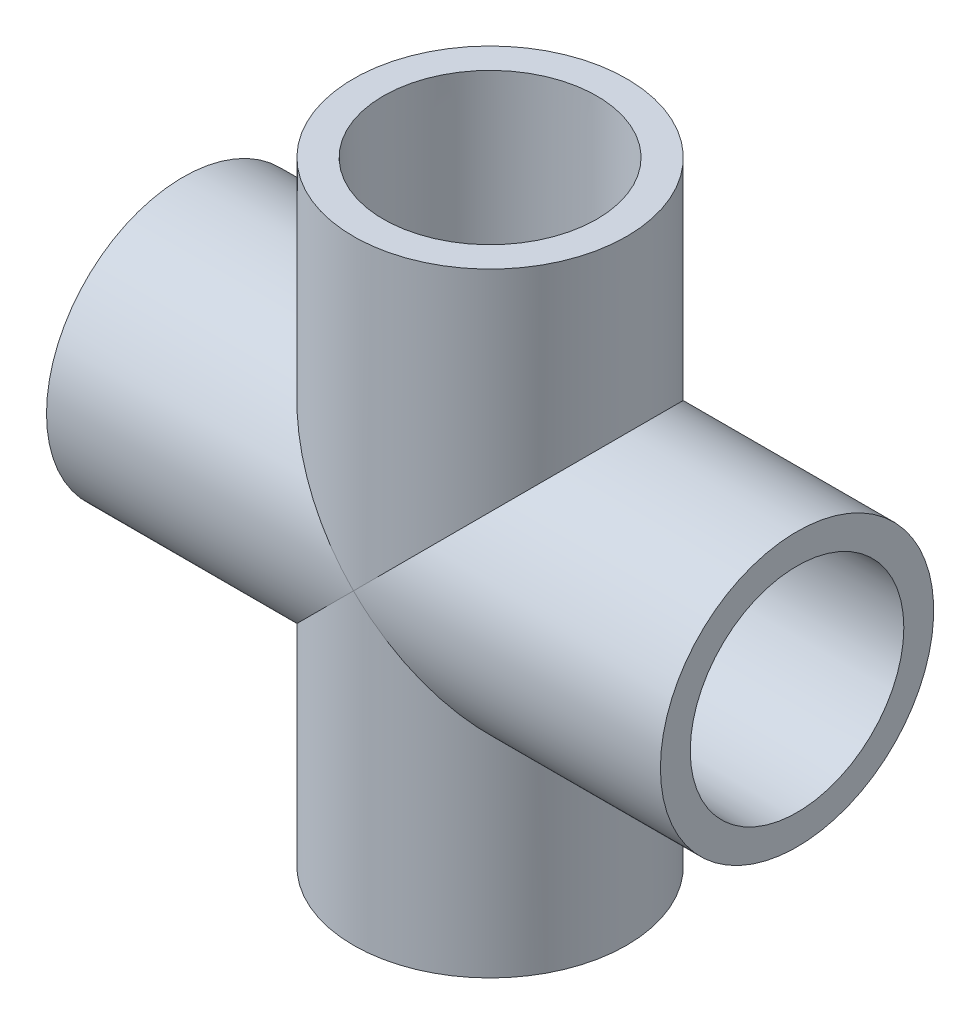
ISO-10303-21;
HEADER;
FILE_DESCRIPTION(('STEP AP214'),'2;1');
FILE_NAME('part.step','',(''),(''),'','','');
FILE_SCHEMA(('AUTOMOTIVE_DESIGN { 1 0 10303 214 1 1 1 1 }'));
ENDSEC;
DATA;
#1=APPLICATION_CONTEXT('core data for automotive mechanical design processes');
#2=APPLICATION_PROTOCOL_DEFINITION('international standard','automotive_design',2000,#1);
#3=PRODUCT_CONTEXT('',#1,'mechanical');
#4=PRODUCT('Part','Part','',(#3));
#5=PRODUCT_RELATED_PRODUCT_CATEGORY('part','',(#4));
#6=PRODUCT_DEFINITION_FORMATION('','',#4);
#7=PRODUCT_DEFINITION_CONTEXT('part definition',#1,'design');
#8=PRODUCT_DEFINITION('design','',#6,#7);
#9=PRODUCT_DEFINITION_SHAPE('','',#8);
#10=(LENGTH_UNIT() NAMED_UNIT(*) SI_UNIT(.MILLI.,.METRE.));
#11=(NAMED_UNIT(*) PLANE_ANGLE_UNIT() SI_UNIT($,.RADIAN.));
#12=(NAMED_UNIT(*) SI_UNIT($,.STERADIAN.) SOLID_ANGLE_UNIT());
#13=UNCERTAINTY_MEASURE_WITH_UNIT(LENGTH_MEASURE(1.E-05),#10,'distance_accuracy_value','');
#14=(GEOMETRIC_REPRESENTATION_CONTEXT(3) GLOBAL_UNCERTAINTY_ASSIGNED_CONTEXT((#13)) GLOBAL_UNIT_ASSIGNED_CONTEXT((#10,
#11,#12)) REPRESENTATION_CONTEXT('',''));
#15=CARTESIAN_POINT('',(0.,0.,0.));
#16=DIRECTION('',(0.,0.,1.));
#17=DIRECTION('',(1.,0.,0.));
#18=AXIS2_PLACEMENT_3D('',#15,#16,#17);
#19=CARTESIAN_POINT('',(0.,13.49375,0.));
#20=DIRECTION('',(0.,-1.,0.));
#21=DIRECTION('',(1.,0.,0.));
#22=AXIS2_PLACEMENT_3D('',#19,#20,#21);
#23=PLANE('',#22);
#24=CARTESIAN_POINT('',(0.,13.49375,0.));
#25=DIRECTION('',(0.,-1.,0.));
#26=DIRECTION('',(1.,0.,0.));
#27=AXIS2_PLACEMENT_3D('',#24,#25,#26);
#28=CIRCLE('',#27,10.6172);
#29=CARTESIAN_POINT('',(10.6172,13.49375,0.));
#30=VERTEX_POINT('',#29);
#31=EDGE_CURVE('E80',#30,#30,#28,.T.);
#32=ORIENTED_EDGE('',*,*,#31,.F.);
#33=EDGE_LOOP('',(#32));
#34=FACE_BOUND('',#33,.T.);
#35=CARTESIAN_POINT('',(0.,13.49375,0.));
#36=DIRECTION('',(0.,1.,0.));
#37=DIRECTION('',(-1.,0.,0.));
#38=AXIS2_PLACEMENT_3D('',#35,#36,#37);
#39=CIRCLE('',#38,7.89940000000001);
#40=CARTESIAN_POINT('',(-7.89940000000001,13.49375,0.));
#41=VERTEX_POINT('',#40);
#42=EDGE_CURVE('E124',#41,#41,#39,.T.);
#43=ORIENTED_EDGE('',*,*,#42,.F.);
#44=EDGE_LOOP('',(#43));
#45=FACE_BOUND('',#44,.T.);
#46=ADVANCED_FACE('F32',(#34,#45),#23,.F.);
#47=CARTESIAN_POINT('',(0.,-13.49375,0.));
#48=DIRECTION('',(0.,-1.,0.));
#49=DIRECTION('',(1.,0.,0.));
#50=AXIS2_PLACEMENT_3D('',#47,#48,#49);
#51=PLANE('',#50);
#52=CARTESIAN_POINT('',(0.,-13.49375,0.));
#53=DIRECTION('',(0.,1.,0.));
#54=DIRECTION('',(-1.,0.,0.));
#55=AXIS2_PLACEMENT_3D('',#52,#53,#54);
#56=CIRCLE('',#55,7.89940000000001);
#57=CARTESIAN_POINT('',(-7.89940000000001,-13.49375,0.));
#58=VERTEX_POINT('',#57);
#59=EDGE_CURVE('E127',#58,#58,#56,.T.);
#60=ORIENTED_EDGE('',*,*,#59,.T.);
#61=EDGE_LOOP('',(#60));
#62=FACE_BOUND('',#61,.T.);
#63=CARTESIAN_POINT('',(0.,-13.49375,0.));
#64=DIRECTION('',(0.,-1.,0.));
#65=DIRECTION('',(1.,0.,0.));
#66=AXIS2_PLACEMENT_3D('',#63,#64,#65);
#67=CIRCLE('',#66,10.6172);
#68=CARTESIAN_POINT('',(10.6172,-13.49375,0.));
#69=VERTEX_POINT('',#68);
#70=EDGE_CURVE('E115',#69,#69,#67,.T.);
#71=ORIENTED_EDGE('',*,*,#70,.T.);
#72=EDGE_LOOP('',(#71));
#73=FACE_BOUND('',#72,.T.);
#74=ADVANCED_FACE('F131',(#62,#73),#51,.T.);
#75=CARTESIAN_POINT('',(30.95625,0.,0.));
#76=DIRECTION('',(1.,0.,0.));
#77=DIRECTION('',(0.,0.,-1.));
#78=AXIS2_PLACEMENT_3D('',#75,#76,#77);
#79=CYLINDRICAL_SURFACE('',#78,7.8994);
#80=CARTESIAN_POINT('',(13.49375,0.,0.));
#81=DIRECTION('',(1.,0.,0.));
#82=DIRECTION('',(0.,0.,-1.));
#83=AXIS2_PLACEMENT_3D('',#80,#81,#82);
#84=CIRCLE('',#83,7.8994);
#85=CARTESIAN_POINT('',(13.49375,0.,-7.8994));
#86=VERTEX_POINT('',#85);
#87=EDGE_CURVE('E121',#86,#86,#84,.T.);
#88=ORIENTED_EDGE('',*,*,#87,.T.);
#89=EDGE_LOOP('',(#88));
#90=FACE_BOUND('',#89,.T.);
#91=CARTESIAN_POINT('',(0.,0.,0.));
#92=DIRECTION('',(0.707106781186548,-0.707106781186547,0.));
#93=DIRECTION('',(0.707106781186547,0.707106781186548,0.));
#94=AXIS2_PLACEMENT_3D('',#91,#92,#93);
#95=ELLIPSE('',#94,11.17143861461,7.8994);
#96=CARTESIAN_POINT('',(0.,0.,7.8994));
#97=VERTEX_POINT('',#96);
#98=CARTESIAN_POINT('',(0.,0.,-7.8994));
#99=VERTEX_POINT('',#98);
#100=EDGE_CURVE('E45',#97,#99,#95,.F.);
#101=ORIENTED_EDGE('',*,*,#100,.T.);
#102=CARTESIAN_POINT('',(0.,0.,0.));
#103=DIRECTION('',(0.707106781186547,0.707106781186548,0.));
#104=DIRECTION('',(0.707106781186548,-0.707106781186547,0.));
#105=AXIS2_PLACEMENT_3D('',#102,#103,#104);
#106=ELLIPSE('',#105,11.17143861461,7.8994);
#107=EDGE_CURVE('E11',#99,#97,#106,.F.);
#108=ORIENTED_EDGE('',*,*,#107,.T.);
#109=EDGE_LOOP('',(#101,#108));
#110=FACE_BOUND('',#109,.T.);
#111=ADVANCED_FACE('F72',(#90,#110),#79,.F.);
#112=CARTESIAN_POINT('',(-13.49375,0.,0.));
#113=DIRECTION('',(1.,0.,0.));
#114=DIRECTION('',(0.,0.,-1.));
#115=AXIS2_PLACEMENT_3D('',#112,#113,#114);
#116=CIRCLE('',#115,7.8994);
#117=CARTESIAN_POINT('',(-13.49375,0.,-7.8994));
#118=VERTEX_POINT('',#117);
#119=EDGE_CURVE('E118',#118,#118,#116,.T.);
#120=ORIENTED_EDGE('',*,*,#119,.F.);
#121=EDGE_LOOP('',(#120));
#122=FACE_BOUND('',#121,.T.);
#123=CARTESIAN_POINT('',(0.,0.,0.));
#124=DIRECTION('',(0.707106781186548,-0.707106781186547,0.));
#125=DIRECTION('',(0.707106781186547,0.707106781186548,0.));
#126=AXIS2_PLACEMENT_3D('',#123,#124,#125);
#127=ELLIPSE('',#126,11.17143861461,7.8994);
#128=EDGE_CURVE('E62',#97,#99,#127,.T.);
#129=ORIENTED_EDGE('',*,*,#128,.T.);
#130=CARTESIAN_POINT('',(0.,0.,0.));
#131=DIRECTION('',(0.707106781186547,0.707106781186548,0.));
#132=DIRECTION('',(0.707106781186548,-0.707106781186547,0.));
#133=AXIS2_PLACEMENT_3D('',#130,#131,#132);
#134=ELLIPSE('',#133,11.17143861461,7.8994);
#135=EDGE_CURVE('E40',#99,#97,#134,.T.);
#136=ORIENTED_EDGE('',*,*,#135,.T.);
#137=EDGE_LOOP('',(#129,#136));
#138=FACE_BOUND('',#137,.T.);
#139=ADVANCED_FACE('F73',(#122,#138),#79,.F.);
#140=CARTESIAN_POINT('',(-13.49375,0.,0.));
#141=DIRECTION('',(1.,0.,0.));
#142=DIRECTION('',(0.,0.,-1.));
#143=AXIS2_PLACEMENT_3D('',#140,#141,#142);
#144=PLANE('',#143);
#145=ORIENTED_EDGE('',*,*,#119,.T.);
#146=EDGE_LOOP('',(#145));
#147=FACE_BOUND('',#146,.T.);
#148=CARTESIAN_POINT('',(-13.49375,0.,0.));
#149=DIRECTION('',(-1.,0.,0.));
#150=DIRECTION('',(0.,0.,1.));
#151=AXIS2_PLACEMENT_3D('',#148,#149,#150);
#152=CIRCLE('',#151,10.6172);
#153=CARTESIAN_POINT('',(-13.49375,0.,10.6172));
#154=VERTEX_POINT('',#153);
#155=EDGE_CURVE('E92',#154,#154,#152,.T.);
#156=ORIENTED_EDGE('',*,*,#155,.T.);
#157=EDGE_LOOP('',(#156));
#158=FACE_BOUND('',#157,.T.);
#159=ADVANCED_FACE('F179',(#147,#158),#144,.F.);
#160=CARTESIAN_POINT('',(13.49375,0.,0.));
#161=DIRECTION('',(1.,0.,0.));
#162=DIRECTION('',(0.,0.,-1.));
#163=AXIS2_PLACEMENT_3D('',#160,#161,#162);
#164=PLANE('',#163);
#165=CARTESIAN_POINT('',(13.49375,0.,0.));
#166=DIRECTION('',(1.,0.,0.));
#167=DIRECTION('',(0.,0.,-1.));
#168=AXIS2_PLACEMENT_3D('',#165,#166,#167);
#169=CIRCLE('',#168,10.6172);
#170=CARTESIAN_POINT('',(13.49375,0.,-10.6172));
#171=VERTEX_POINT('',#170);
#172=EDGE_CURVE('E70',#171,#171,#169,.F.);
#173=ORIENTED_EDGE('',*,*,#172,.F.);
#174=EDGE_LOOP('',(#173));
#175=FACE_BOUND('',#174,.T.);
#176=ORIENTED_EDGE('',*,*,#87,.F.);
#177=EDGE_LOOP('',(#176));
#178=FACE_BOUND('',#177,.T.);
#179=ADVANCED_FACE('F175',(#175,#178),#164,.T.);
#180=CARTESIAN_POINT('',(13.49375,0.,0.));
#181=DIRECTION('',(-1.,0.,0.));
#182=DIRECTION('',(0.,0.,1.));
#183=AXIS2_PLACEMENT_3D('',#180,#181,#182);
#184=CYLINDRICAL_SURFACE('',#183,13.7795);
#185=CARTESIAN_POINT('',(30.95625,0.,0.));
#186=DIRECTION('',(-1.,0.,0.));
#187=DIRECTION('',(0.,0.,1.));
#188=AXIS2_PLACEMENT_3D('',#185,#186,#187);
#189=CIRCLE('',#188,13.7795);
#190=CARTESIAN_POINT('',(30.95625,0.,13.7795));
#191=VERTEX_POINT('',#190);
#192=EDGE_CURVE('E103',#191,#191,#189,.T.);
#193=ORIENTED_EDGE('',*,*,#192,.T.);
#194=EDGE_LOOP('',(#193));
#195=FACE_BOUND('',#194,.T.);
#196=CARTESIAN_POINT('',(0.,0.,0.));
#197=DIRECTION('',(-0.707106781186547,-0.707106781186547,0.));
#198=DIRECTION('',(-0.707106781186547,0.707106781186547,0.));
#199=AXIS2_PLACEMENT_3D('',#196,#197,#198);
#200=ELLIPSE('',#199,19.4871557827201,13.7795);
#201=CARTESIAN_POINT('',(0.,0.,-13.7795));
#202=VERTEX_POINT('',#201);
#203=CARTESIAN_POINT('',(0.,0.,13.7795));
#204=VERTEX_POINT('',#203);
#205=EDGE_CURVE('E107',#202,#204,#200,.T.);
#206=ORIENTED_EDGE('',*,*,#205,.F.);
#207=CARTESIAN_POINT('',(0.,0.,0.));
#208=DIRECTION('',(0.707106781186547,-0.707106781186548,0.));
#209=DIRECTION('',(-0.707106781186548,-0.707106781186547,0.));
#210=AXIS2_PLACEMENT_3D('',#207,#208,#209);
#211=ELLIPSE('',#210,19.4871557827201,13.7795);
#212=EDGE_CURVE('E98',#202,#204,#211,.T.);
#213=ORIENTED_EDGE('',*,*,#212,.T.);
#214=EDGE_LOOP('',(#206,#213));
#215=FACE_BOUND('',#214,.T.);
#216=ADVANCED_FACE('F178',(#195,#215),#184,.T.);
#217=CARTESIAN_POINT('',(-30.95625,0.,0.));
#218=DIRECTION('',(-1.,0.,0.));
#219=DIRECTION('',(0.,0.,1.));
#220=AXIS2_PLACEMENT_3D('',#217,#218,#219);
#221=CIRCLE('',#220,13.7795);
#222=CARTESIAN_POINT('',(-30.95625,0.,13.7795));
#223=VERTEX_POINT('',#222);
#224=EDGE_CURVE('E95',#223,#223,#221,.T.);
#225=ORIENTED_EDGE('',*,*,#224,.F.);
#226=EDGE_LOOP('',(#225));
#227=FACE_BOUND('',#226,.T.);
#228=CARTESIAN_POINT('',(0.,0.,0.));
#229=DIRECTION('',(-0.707106781186548,-0.707106781186547,0.));
#230=DIRECTION('',(0.707106781186547,-0.707106781186548,0.));
#231=AXIS2_PLACEMENT_3D('',#228,#229,#230);
#232=ELLIPSE('',#231,19.4871557827201,13.7795);
#233=EDGE_CURVE('E86',#204,#202,#232,.T.);
#234=ORIENTED_EDGE('',*,*,#233,.T.);
#235=CARTESIAN_POINT('',(0.,0.,0.));
#236=DIRECTION('',(-0.707106781186547,0.707106781186547,0.));
#237=DIRECTION('',(-0.707106781186547,-0.707106781186547,0.));
#238=AXIS2_PLACEMENT_3D('',#235,#236,#237);
#239=ELLIPSE('',#238,19.4871557827201,13.7795);
#240=EDGE_CURVE('E52',#204,#202,#239,.F.);
#241=ORIENTED_EDGE('',*,*,#240,.F.);
#242=EDGE_LOOP('',(#234,#241));
#243=FACE_BOUND('',#242,.T.);
#244=ADVANCED_FACE('F169',(#227,#243),#184,.T.);
#245=CARTESIAN_POINT('',(-13.49375,0.,0.));
#246=DIRECTION('',(-1.,0.,0.));
#247=DIRECTION('',(0.,0.,1.));
#248=AXIS2_PLACEMENT_3D('',#245,#246,#247);
#249=CONICAL_SURFACE('',#248,10.6172,0.00872705116564709);
#250=CARTESIAN_POINT('',(-30.95625,0.,0.));
#251=DIRECTION('',(-1.,0.,0.));
#252=DIRECTION('',(0.,0.,1.));
#253=AXIS2_PLACEMENT_3D('',#250,#251,#252);
#254=CIRCLE('',#253,10.7696);
#255=CARTESIAN_POINT('',(-30.95625,0.,10.7696));
#256=VERTEX_POINT('',#255);
#257=EDGE_CURVE('E89',#256,#256,#254,.T.);
#258=ORIENTED_EDGE('',*,*,#257,.T.);
#259=EDGE_LOOP('',(#258));
#260=FACE_BOUND('',#259,.T.);
#261=ORIENTED_EDGE('',*,*,#155,.F.);
#262=EDGE_LOOP('',(#261));
#263=FACE_BOUND('',#262,.T.);
#264=ADVANCED_FACE('F161',(#260,#263),#249,.F.);
#265=CARTESIAN_POINT('',(30.95625,0.,0.));
#266=DIRECTION('',(1.,0.,0.));
#267=DIRECTION('',(0.,0.,-1.));
#268=AXIS2_PLACEMENT_3D('',#265,#266,#267);
#269=CONICAL_SURFACE('',#268,10.7696,0.00872705116564689);
#270=CARTESIAN_POINT('',(30.95625,0.,0.));
#271=DIRECTION('',(-1.,0.,0.));
#272=DIRECTION('',(0.,0.,1.));
#273=AXIS2_PLACEMENT_3D('',#270,#271,#272);
#274=CIRCLE('',#273,10.7696);
#275=CARTESIAN_POINT('',(30.95625,0.,10.7696));
#276=VERTEX_POINT('',#275);
#277=EDGE_CURVE('E100',#276,#276,#274,.T.);
#278=ORIENTED_EDGE('',*,*,#277,.F.);
#279=EDGE_LOOP('',(#278));
#280=FACE_BOUND('',#279,.T.);
#281=ORIENTED_EDGE('',*,*,#172,.T.);
#282=EDGE_LOOP('',(#281));
#283=FACE_BOUND('',#282,.T.);
#284=ADVANCED_FACE('F157',(#280,#283),#269,.F.);
#285=CARTESIAN_POINT('',(0.,30.95625,0.));
#286=DIRECTION('',(0.,1.,0.));
#287=DIRECTION('',(-1.,0.,0.));
#288=AXIS2_PLACEMENT_3D('',#285,#286,#287);
#289=CONICAL_SURFACE('',#288,10.7696,0.00872705116564708);
#290=CARTESIAN_POINT('',(0.,30.95625,0.));
#291=DIRECTION('',(0.,-1.,0.));
#292=DIRECTION('',(1.,0.,0.));
#293=AXIS2_PLACEMENT_3D('',#290,#291,#292);
#294=CIRCLE('',#293,10.7696);
#295=CARTESIAN_POINT('',(10.7696,30.95625,0.));
#296=VERTEX_POINT('',#295);
#297=EDGE_CURVE('E83',#296,#296,#294,.T.);
#298=ORIENTED_EDGE('',*,*,#297,.F.);
#299=EDGE_LOOP('',(#298));
#300=FACE_BOUND('',#299,.T.);
#301=ORIENTED_EDGE('',*,*,#31,.T.);
#302=EDGE_LOOP('',(#301));
#303=FACE_BOUND('',#302,.T.);
#304=ADVANCED_FACE('F160',(#300,#303),#289,.F.);
#305=CARTESIAN_POINT('',(13.7795,30.95625,0.));
#306=DIRECTION('',(0.,1.,0.));
#307=DIRECTION('',(-1.,0.,0.));
#308=AXIS2_PLACEMENT_3D('',#305,#306,#307);
#309=PLANE('',#308);
#310=ORIENTED_EDGE('',*,*,#297,.T.);
#311=EDGE_LOOP('',(#310));
#312=FACE_BOUND('',#311,.T.);
#313=CARTESIAN_POINT('',(0.,30.95625,0.));
#314=DIRECTION('',(0.,-1.,0.));
#315=DIRECTION('',(1.,0.,0.));
#316=AXIS2_PLACEMENT_3D('',#313,#314,#315);
#317=CIRCLE('',#316,13.7795);
#318=CARTESIAN_POINT('',(13.7795,30.95625,0.));
#319=VERTEX_POINT('',#318);
#320=EDGE_CURVE('E77',#319,#319,#317,.T.);
#321=ORIENTED_EDGE('',*,*,#320,.F.);
#322=EDGE_LOOP('',(#321));
#323=FACE_BOUND('',#322,.T.);
#324=ADVANCED_FACE('F34',(#312,#323),#309,.T.);
#325=CARTESIAN_POINT('',(0.,0.,0.));
#326=DIRECTION('',(0.,-1.,0.));
#327=DIRECTION('',(1.,0.,0.));
#328=AXIS2_PLACEMENT_3D('',#325,#326,#327);
#329=CYLINDRICAL_SURFACE('',#328,13.7795);
#330=ORIENTED_EDGE('',*,*,#212,.F.);
#331=ORIENTED_EDGE('',*,*,#233,.F.);
#332=EDGE_LOOP('',(#330,#331));
#333=FACE_BOUND('',#332,.T.);
#334=ORIENTED_EDGE('',*,*,#320,.T.);
#335=EDGE_LOOP('',(#334));
#336=FACE_BOUND('',#335,.T.);
#337=ADVANCED_FACE('F173',(#333,#336),#329,.T.);
#338=CARTESIAN_POINT('',(-30.95625,-13.7795,0.));
#339=DIRECTION('',(-1.,0.,0.));
#340=DIRECTION('',(0.,0.,1.));
#341=AXIS2_PLACEMENT_3D('',#338,#339,#340);
#342=PLANE('',#341);
#343=ORIENTED_EDGE('',*,*,#224,.T.);
#344=EDGE_LOOP('',(#343));
#345=FACE_BOUND('',#344,.T.);
#346=ORIENTED_EDGE('',*,*,#257,.F.);
#347=EDGE_LOOP('',(#346));
#348=FACE_BOUND('',#347,.T.);
#349=ADVANCED_FACE('F165',(#345,#348),#342,.T.);
#350=CARTESIAN_POINT('',(30.95625,-13.7795,0.));
#351=DIRECTION('',(1.,0.,0.));
#352=DIRECTION('',(0.,0.,-1.));
#353=AXIS2_PLACEMENT_3D('',#350,#351,#352);
#354=PLANE('',#353);
#355=ORIENTED_EDGE('',*,*,#277,.T.);
#356=EDGE_LOOP('',(#355));
#357=FACE_BOUND('',#356,.T.);
#358=ORIENTED_EDGE('',*,*,#192,.F.);
#359=EDGE_LOOP('',(#358));
#360=FACE_BOUND('',#359,.T.);
#361=ADVANCED_FACE('F156',(#357,#360),#354,.T.);
#362=CARTESIAN_POINT('',(0.,-13.49375,0.));
#363=DIRECTION('',(0.,1.,0.));
#364=DIRECTION('',(-1.,0.,0.));
#365=AXIS2_PLACEMENT_3D('',#362,#363,#364);
#366=CYLINDRICAL_SURFACE('',#365,13.7795);
#367=ORIENTED_EDGE('',*,*,#205,.T.);
#368=ORIENTED_EDGE('',*,*,#240,.T.);
#369=EDGE_LOOP('',(#367,#368));
#370=FACE_BOUND('',#369,.T.);
#371=CARTESIAN_POINT('',(0.,-30.95625,0.));
#372=DIRECTION('',(0.,-1.,0.));
#373=DIRECTION('',(1.,0.,0.));
#374=AXIS2_PLACEMENT_3D('',#371,#372,#373);
#375=CIRCLE('',#374,13.7795);
#376=CARTESIAN_POINT('',(13.7795,-30.95625,0.));
#377=VERTEX_POINT('',#376);
#378=EDGE_CURVE('E109',#377,#377,#375,.T.);
#379=ORIENTED_EDGE('',*,*,#378,.F.);
#380=EDGE_LOOP('',(#379));
#381=FACE_BOUND('',#380,.T.);
#382=ADVANCED_FACE('F152',(#370,#381),#366,.T.);
#383=CARTESIAN_POINT('',(0.,-13.49375,0.));
#384=DIRECTION('',(0.,-1.,0.));
#385=DIRECTION('',(1.,0.,0.));
#386=AXIS2_PLACEMENT_3D('',#383,#384,#385);
#387=CONICAL_SURFACE('',#386,10.6172,0.00872705116564748);
#388=CARTESIAN_POINT('',(0.,-30.95625,0.));
#389=DIRECTION('',(0.,-1.,0.));
#390=DIRECTION('',(1.,0.,0.));
#391=AXIS2_PLACEMENT_3D('',#388,#389,#390);
#392=CIRCLE('',#391,10.7696);
#393=CARTESIAN_POINT('',(10.7696,-30.95625,0.));
#394=VERTEX_POINT('',#393);
#395=EDGE_CURVE('E112',#394,#394,#392,.T.);
#396=ORIENTED_EDGE('',*,*,#395,.T.);
#397=EDGE_LOOP('',(#396));
#398=FACE_BOUND('',#397,.T.);
#399=ORIENTED_EDGE('',*,*,#70,.F.);
#400=EDGE_LOOP('',(#399));
#401=FACE_BOUND('',#400,.T.);
#402=ADVANCED_FACE('F155',(#398,#401),#387,.F.);
#403=CARTESIAN_POINT('',(13.7795,-30.95625,0.));
#404=DIRECTION('',(0.,-1.,0.));
#405=DIRECTION('',(1.,0.,0.));
#406=AXIS2_PLACEMENT_3D('',#403,#404,#405);
#407=PLANE('',#406);
#408=ORIENTED_EDGE('',*,*,#378,.T.);
#409=EDGE_LOOP('',(#408));
#410=FACE_BOUND('',#409,.T.);
#411=ORIENTED_EDGE('',*,*,#395,.F.);
#412=EDGE_LOOP('',(#411));
#413=FACE_BOUND('',#412,.T.);
#414=ADVANCED_FACE('F138',(#410,#413),#407,.T.);
#415=CARTESIAN_POINT('',(0.,30.95625,0.));
#416=DIRECTION('',(0.,1.,0.));
#417=DIRECTION('',(-1.,0.,0.));
#418=AXIS2_PLACEMENT_3D('',#415,#416,#417);
#419=CYLINDRICAL_SURFACE('',#418,7.89940000000001);
#420=ORIENTED_EDGE('',*,*,#42,.T.);
#421=EDGE_LOOP('',(#420));
#422=FACE_BOUND('',#421,.T.);
#423=ORIENTED_EDGE('',*,*,#100,.F.);
#424=ORIENTED_EDGE('',*,*,#135,.F.);
#425=EDGE_LOOP('',(#423,#424));
#426=FACE_BOUND('',#425,.T.);
#427=ADVANCED_FACE('F69',(#422,#426),#419,.F.);
#428=ORIENTED_EDGE('',*,*,#128,.F.);
#429=ORIENTED_EDGE('',*,*,#107,.F.);
#430=EDGE_LOOP('',(#428,#429));
#431=FACE_BOUND('',#430,.T.);
#432=ORIENTED_EDGE('',*,*,#59,.F.);
#433=EDGE_LOOP('',(#432));
#434=FACE_BOUND('',#433,.T.);
#435=ADVANCED_FACE('F63',(#431,#434),#419,.F.);
#436=CLOSED_SHELL('',(#46,#74,#111,#139,#159,#179,#216,#244,#264,#284,#304,#324,#337,#349,#361,
#382,#402,#414,#427,#435));
#437=MANIFOLD_SOLID_BREP('B2',#436);
#438=ADVANCED_BREP_SHAPE_REPRESENTATION('',(#18,#437),#14);
#439=SHAPE_DEFINITION_REPRESENTATION(#9,#438);
ENDSEC;
END-ISO-10303-21;
